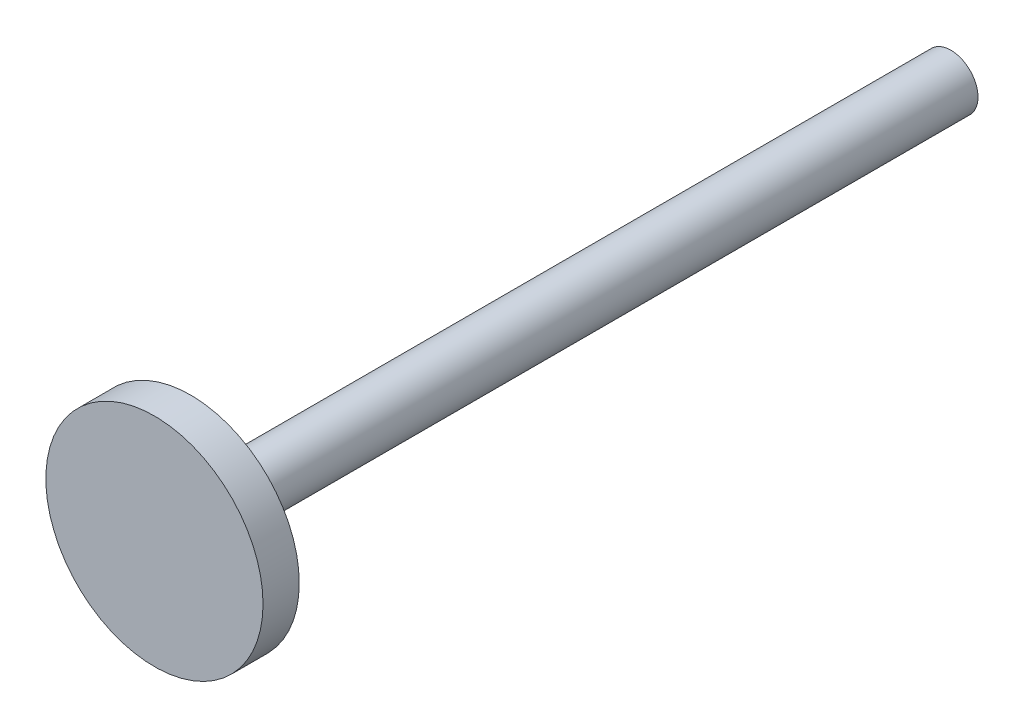
ISO-10303-21;
HEADER;
FILE_DESCRIPTION(('STEP AP214'),'2;1');
FILE_NAME('part.step','',(''),(''),'','','');
FILE_SCHEMA(('AUTOMOTIVE_DESIGN { 1 0 10303 214 1 1 1 1 }'));
ENDSEC;
DATA;
#1=APPLICATION_CONTEXT('core data for automotive mechanical design processes');
#2=APPLICATION_PROTOCOL_DEFINITION('international standard','automotive_design',2000,#1);
#3=PRODUCT_CONTEXT('',#1,'mechanical');
#4=PRODUCT('Part','Part','',(#3));
#5=PRODUCT_RELATED_PRODUCT_CATEGORY('part','',(#4));
#6=PRODUCT_DEFINITION_FORMATION('','',#4);
#7=PRODUCT_DEFINITION_CONTEXT('part definition',#1,'design');
#8=PRODUCT_DEFINITION('design','',#6,#7);
#9=PRODUCT_DEFINITION_SHAPE('','',#8);
#10=(LENGTH_UNIT() NAMED_UNIT(*) SI_UNIT(.MILLI.,.METRE.));
#11=(NAMED_UNIT(*) PLANE_ANGLE_UNIT() SI_UNIT($,.RADIAN.));
#12=(NAMED_UNIT(*) SI_UNIT($,.STERADIAN.) SOLID_ANGLE_UNIT());
#13=UNCERTAINTY_MEASURE_WITH_UNIT(LENGTH_MEASURE(1.E-05),#10,'distance_accuracy_value','');
#14=(GEOMETRIC_REPRESENTATION_CONTEXT(3) GLOBAL_UNCERTAINTY_ASSIGNED_CONTEXT((#13)) GLOBAL_UNIT_ASSIGNED_CONTEXT((#10,
#11,#12)) REPRESENTATION_CONTEXT('',''));
#15=CARTESIAN_POINT('',(0.,0.,0.));
#16=DIRECTION('',(0.,0.,1.));
#17=DIRECTION('',(1.,0.,0.));
#18=AXIS2_PLACEMENT_3D('',#15,#16,#17);
#19=CARTESIAN_POINT('',(0.,0.,279.4));
#20=DIRECTION('',(0.,0.,-1.));
#21=DIRECTION('',(-1.,0.,0.));
#22=AXIS2_PLACEMENT_3D('',#19,#20,#21);
#23=CYLINDRICAL_SURFACE('',#22,9.525);
#24=CARTESIAN_POINT('',(0.,0.,0.));
#25=DIRECTION('',(0.,0.,1.));
#26=DIRECTION('',(1.,0.,0.));
#27=AXIS2_PLACEMENT_3D('',#24,#25,#26);
#28=CIRCLE('',#27,9.525);
#29=CARTESIAN_POINT('',(9.525,0.,0.));
#30=VERTEX_POINT('',#29);
#31=EDGE_CURVE('E39',#30,#30,#28,.T.);
#32=ORIENTED_EDGE('',*,*,#31,.T.);
#33=EDGE_LOOP('',(#32));
#34=FACE_BOUND('',#33,.T.);
#35=CARTESIAN_POINT('',(0.,0.,266.7));
#36=DIRECTION('',(0.,0.,1.));
#37=DIRECTION('',(1.,0.,0.));
#38=AXIS2_PLACEMENT_3D('',#35,#36,#37);
#39=CIRCLE('',#38,9.525);
#40=CARTESIAN_POINT('',(9.525,0.,266.7));
#41=VERTEX_POINT('',#40);
#42=EDGE_CURVE('E10',#41,#41,#39,.T.);
#43=ORIENTED_EDGE('',*,*,#42,.F.);
#44=EDGE_LOOP('',(#43));
#45=FACE_BOUND('',#44,.T.);
#46=ADVANCED_FACE('F33',(#34,#45),#23,.T.);
#47=CARTESIAN_POINT('',(0.,0.,0.));
#48=DIRECTION('',(0.,0.,1.));
#49=DIRECTION('',(1.,0.,0.));
#50=AXIS2_PLACEMENT_3D('',#47,#48,#49);
#51=PLANE('',#50);
#52=ORIENTED_EDGE('',*,*,#31,.F.);
#53=EDGE_LOOP('',(#52));
#54=FACE_BOUND('',#53,.T.);
#55=ADVANCED_FACE('F58',(#54),#51,.F.);
#56=CARTESIAN_POINT('',(0.,0.,266.7));
#57=DIRECTION('',(0.,0.,1.));
#58=DIRECTION('',(1.,0.,0.));
#59=AXIS2_PLACEMENT_3D('',#56,#57,#58);
#60=CYLINDRICAL_SURFACE('',#59,38.1);
#61=CARTESIAN_POINT('',(0.,0.,266.7));
#62=DIRECTION('',(0.,0.,1.));
#63=DIRECTION('',(1.,0.,0.));
#64=AXIS2_PLACEMENT_3D('',#61,#62,#63);
#65=CIRCLE('',#64,38.1);
#66=CARTESIAN_POINT('',(38.1,0.,266.7));
#67=VERTEX_POINT('',#66);
#68=EDGE_CURVE('E43',#67,#67,#65,.T.);
#69=ORIENTED_EDGE('',*,*,#68,.T.);
#70=EDGE_LOOP('',(#69));
#71=FACE_BOUND('',#70,.T.);
#72=CARTESIAN_POINT('',(0.,0.,279.4));
#73=DIRECTION('',(0.,0.,1.));
#74=DIRECTION('',(1.,0.,0.));
#75=AXIS2_PLACEMENT_3D('',#72,#73,#74);
#76=CIRCLE('',#75,38.1);
#77=CARTESIAN_POINT('',(38.1,0.,279.4));
#78=VERTEX_POINT('',#77);
#79=EDGE_CURVE('E47',#78,#78,#76,.T.);
#80=ORIENTED_EDGE('',*,*,#79,.F.);
#81=EDGE_LOOP('',(#80));
#82=FACE_BOUND('',#81,.T.);
#83=ADVANCED_FACE('F55',(#71,#82),#60,.T.);
#84=CARTESIAN_POINT('',(0.,0.,266.7));
#85=DIRECTION('',(0.,0.,1.));
#86=DIRECTION('',(1.,0.,0.));
#87=AXIS2_PLACEMENT_3D('',#84,#85,#86);
#88=PLANE('',#87);
#89=ORIENTED_EDGE('',*,*,#42,.T.);
#90=EDGE_LOOP('',(#89));
#91=FACE_BOUND('',#90,.T.);
#92=ORIENTED_EDGE('',*,*,#68,.F.);
#93=EDGE_LOOP('',(#92));
#94=FACE_BOUND('',#93,.T.);
#95=ADVANCED_FACE('F57',(#91,#94),#88,.F.);
#96=CARTESIAN_POINT('',(0.,0.,279.4));
#97=DIRECTION('',(0.,0.,1.));
#98=DIRECTION('',(1.,0.,0.));
#99=AXIS2_PLACEMENT_3D('',#96,#97,#98);
#100=PLANE('',#99);
#101=ORIENTED_EDGE('',*,*,#79,.T.);
#102=EDGE_LOOP('',(#101));
#103=FACE_BOUND('',#102,.T.);
#104=ADVANCED_FACE('F53',(#103),#100,.T.);
#105=CLOSED_SHELL('',(#46,#55,#83,#95,#104));
#106=MANIFOLD_SOLID_BREP('B2',#105);
#107=ADVANCED_BREP_SHAPE_REPRESENTATION('',(#18,#106),#14);
#108=SHAPE_DEFINITION_REPRESENTATION(#9,#107);
ENDSEC;
END-ISO-10303-21;
